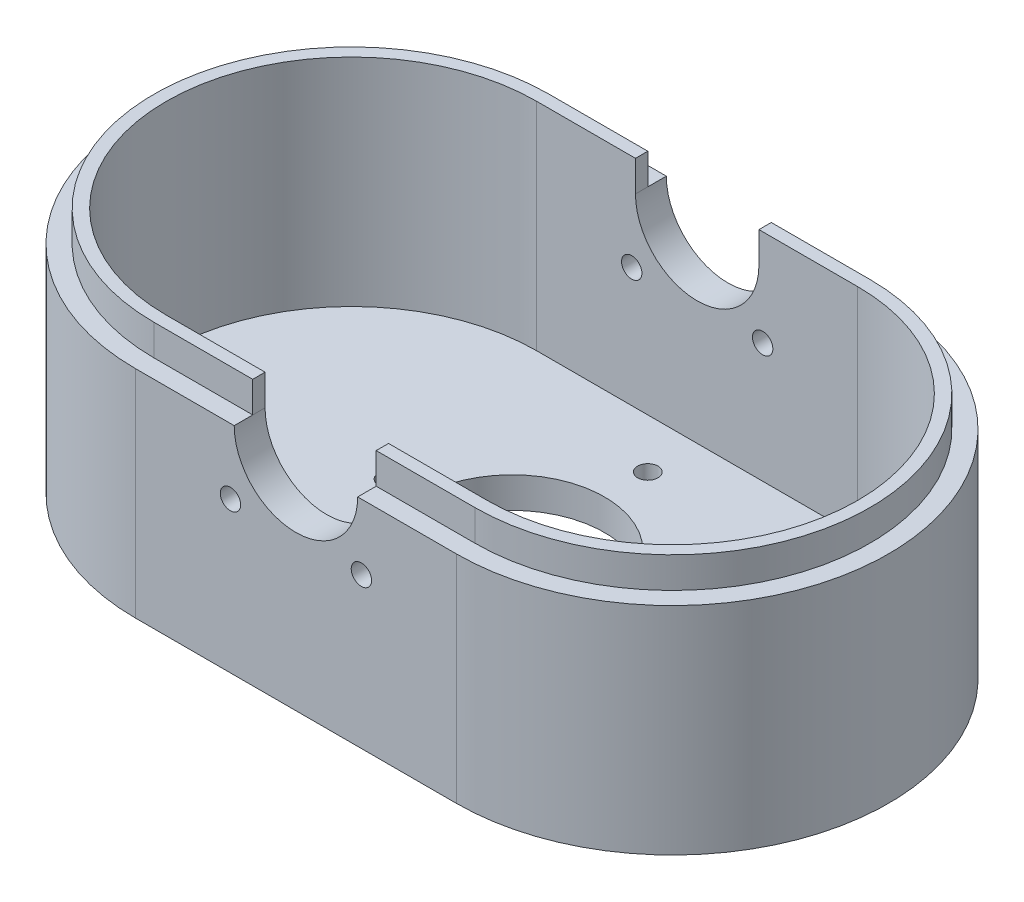
ISO-10303-21;
HEADER;
FILE_DESCRIPTION(('STEP AP214'),'2;1');
FILE_NAME('part.step','',(''),(''),'','','');
FILE_SCHEMA(('AUTOMOTIVE_DESIGN { 1 0 10303 214 1 1 1 1 }'));
ENDSEC;
DATA;
#1=APPLICATION_CONTEXT('core data for automotive mechanical design processes');
#2=APPLICATION_PROTOCOL_DEFINITION('international standard','automotive_design',2000,#1);
#3=PRODUCT_CONTEXT('',#1,'mechanical');
#4=PRODUCT('Part','Part','',(#3));
#5=PRODUCT_RELATED_PRODUCT_CATEGORY('part','',(#4));
#6=PRODUCT_DEFINITION_FORMATION('','',#4);
#7=PRODUCT_DEFINITION_CONTEXT('part definition',#1,'design');
#8=PRODUCT_DEFINITION('design','',#6,#7);
#9=PRODUCT_DEFINITION_SHAPE('','',#8);
#10=(LENGTH_UNIT() NAMED_UNIT(*) SI_UNIT(.MILLI.,.METRE.));
#11=(NAMED_UNIT(*) PLANE_ANGLE_UNIT() SI_UNIT($,.RADIAN.));
#12=(NAMED_UNIT(*) SI_UNIT($,.STERADIAN.) SOLID_ANGLE_UNIT());
#13=UNCERTAINTY_MEASURE_WITH_UNIT(LENGTH_MEASURE(1.E-05),#10,'distance_accuracy_value','');
#14=(GEOMETRIC_REPRESENTATION_CONTEXT(3) GLOBAL_UNCERTAINTY_ASSIGNED_CONTEXT((#13)) GLOBAL_UNIT_ASSIGNED_CONTEXT((#10,
#11,#12)) REPRESENTATION_CONTEXT('',''));
#15=CARTESIAN_POINT('',(0.,0.,0.));
#16=DIRECTION('',(0.,0.,1.));
#17=DIRECTION('',(1.,0.,0.));
#18=AXIS2_PLACEMENT_3D('',#15,#16,#17);
#19=CARTESIAN_POINT('',(26.,35.,0.));
#20=DIRECTION('',(0.,1.,0.));
#21=DIRECTION('',(0.,0.,1.));
#22=AXIS2_PLACEMENT_3D('',#19,#20,#21);
#23=PLANE('',#22);
#24=CARTESIAN_POINT('',(26.,35.,0.));
#25=DIRECTION('',(0.,1.,0.));
#26=DIRECTION('',(0.,0.,1.));
#27=AXIS2_PLACEMENT_3D('',#24,#25,#26);
#28=CIRCLE('',#27,32.);
#29=CARTESIAN_POINT('',(26.,35.,32.));
#30=VERTEX_POINT('',#29);
#31=CARTESIAN_POINT('',(26.,35.,-32.));
#32=VERTEX_POINT('',#31);
#33=EDGE_CURVE('E397',#30,#32,#28,.T.);
#34=ORIENTED_EDGE('',*,*,#33,.F.);
#35=DIRECTION('',(1.,0.,0.));
#36=VECTOR('',#35,1.);
#37=CARTESIAN_POINT('',(10.,35.,32.));
#38=LINE('',#37,#36);
#39=CARTESIAN_POINT('',(10.,35.,32.));
#40=VERTEX_POINT('',#39);
#41=EDGE_CURVE('E366',#40,#30,#38,.T.);
#42=ORIENTED_EDGE('',*,*,#41,.F.);
#43=DIRECTION('',(0.,0.,1.));
#44=VECTOR('',#43,1.);
#45=CARTESIAN_POINT('',(10.,35.,-35.));
#46=LINE('',#45,#44);
#47=CARTESIAN_POINT('',(10.,35.,35.));
#48=VERTEX_POINT('',#47);
#49=EDGE_CURVE('E268',#48,#40,#46,.F.);
#50=ORIENTED_EDGE('',*,*,#49,.F.);
#51=DIRECTION('',(1.,0.,0.));
#52=VECTOR('',#51,1.);
#53=CARTESIAN_POINT('',(-26.,35.,35.));
#54=LINE('',#53,#52);
#55=CARTESIAN_POINT('',(26.,35.,35.));
#56=VERTEX_POINT('',#55);
#57=EDGE_CURVE('E310',#48,#56,#54,.T.);
#58=ORIENTED_EDGE('',*,*,#57,.T.);
#59=CARTESIAN_POINT('',(26.,35.,0.));
#60=DIRECTION('',(0.,1.,0.));
#61=DIRECTION('',(0.,0.,1.));
#62=AXIS2_PLACEMENT_3D('',#59,#60,#61);
#63=CIRCLE('',#62,35.);
#64=CARTESIAN_POINT('',(26.,35.,-35.));
#65=VERTEX_POINT('',#64);
#66=EDGE_CURVE('E300',#56,#65,#63,.T.);
#67=ORIENTED_EDGE('',*,*,#66,.T.);
#68=DIRECTION('',(-1.,0.,0.));
#69=VECTOR('',#68,1.);
#70=CARTESIAN_POINT('',(-26.,35.,-35.));
#71=LINE('',#70,#69);
#72=CARTESIAN_POINT('',(10.,35.,-35.));
#73=VERTEX_POINT('',#72);
#74=EDGE_CURVE('E305',#65,#73,#71,.T.);
#75=ORIENTED_EDGE('',*,*,#74,.T.);
#76=CARTESIAN_POINT('',(10.,35.,-32.));
#77=VERTEX_POINT('',#76);
#78=EDGE_CURVE('E263',#77,#73,#46,.F.);
#79=ORIENTED_EDGE('',*,*,#78,.F.);
#80=DIRECTION('',(-1.,0.,0.));
#81=VECTOR('',#80,1.);
#82=CARTESIAN_POINT('',(26.,35.,-32.));
#83=LINE('',#82,#81);
#84=EDGE_CURVE('E202',#32,#77,#83,.T.);
#85=ORIENTED_EDGE('',*,*,#84,.F.);
#86=EDGE_LOOP('',(#34,#42,#50,#58,#67,#75,#79,#85));
#87=FACE_BOUND('',#86,.T.);
#88=ADVANCED_FACE('F35',(#87),#23,.T.);
#89=CARTESIAN_POINT('',(-26.,35.,0.));
#90=DIRECTION('',(0.,1.,0.));
#91=DIRECTION('',(0.,0.,1.));
#92=AXIS2_PLACEMENT_3D('',#89,#90,#91);
#93=CIRCLE('',#92,32.);
#94=CARTESIAN_POINT('',(-26.,35.,-32.));
#95=VERTEX_POINT('',#94);
#96=CARTESIAN_POINT('',(-26.,35.,32.));
#97=VERTEX_POINT('',#96);
#98=EDGE_CURVE('E238',#95,#97,#93,.T.);
#99=ORIENTED_EDGE('',*,*,#98,.F.);
#100=DIRECTION('',(-1.,0.,0.));
#101=VECTOR('',#100,1.);
#102=CARTESIAN_POINT('',(-9.99999999999999,35.,-32.));
#103=LINE('',#102,#101);
#104=CARTESIAN_POINT('',(-9.99999999999999,35.,-32.));
#105=VERTEX_POINT('',#104);
#106=EDGE_CURVE('E210',#105,#95,#103,.T.);
#107=ORIENTED_EDGE('',*,*,#106,.F.);
#108=DIRECTION('',(0.,0.,1.));
#109=VECTOR('',#108,1.);
#110=CARTESIAN_POINT('',(-9.99999999999999,35.,-35.));
#111=LINE('',#110,#109);
#112=CARTESIAN_POINT('',(-9.99999999999999,35.,-35.));
#113=VERTEX_POINT('',#112);
#114=EDGE_CURVE('E267',#113,#105,#111,.T.);
#115=ORIENTED_EDGE('',*,*,#114,.F.);
#116=CARTESIAN_POINT('',(-26.,35.,-35.));
#117=VERTEX_POINT('',#116);
#118=EDGE_CURVE('E303',#113,#117,#71,.T.);
#119=ORIENTED_EDGE('',*,*,#118,.T.);
#120=CARTESIAN_POINT('',(-26.,35.,0.));
#121=DIRECTION('',(0.,1.,0.));
#122=DIRECTION('',(0.,0.,1.));
#123=AXIS2_PLACEMENT_3D('',#120,#121,#122);
#124=CIRCLE('',#123,35.);
#125=CARTESIAN_POINT('',(-26.,35.,35.));
#126=VERTEX_POINT('',#125);
#127=EDGE_CURVE('E308',#117,#126,#124,.T.);
#128=ORIENTED_EDGE('',*,*,#127,.T.);
#129=CARTESIAN_POINT('',(-9.99999999999999,35.,35.));
#130=VERTEX_POINT('',#129);
#131=EDGE_CURVE('E311',#126,#130,#54,.T.);
#132=ORIENTED_EDGE('',*,*,#131,.T.);
#133=CARTESIAN_POINT('',(-9.99999999999999,35.,32.));
#134=VERTEX_POINT('',#133);
#135=EDGE_CURVE('E272',#134,#130,#111,.T.);
#136=ORIENTED_EDGE('',*,*,#135,.F.);
#137=DIRECTION('',(1.,0.,0.));
#138=VECTOR('',#137,1.);
#139=CARTESIAN_POINT('',(-26.,35.,32.));
#140=LINE('',#139,#138);
#141=EDGE_CURVE('E220',#97,#134,#140,.T.);
#142=ORIENTED_EDGE('',*,*,#141,.F.);
#143=EDGE_LOOP('',(#99,#107,#115,#119,#128,#132,#136,#142));
#144=FACE_BOUND('',#143,.T.);
#145=ADVANCED_FACE('F354',(#144),#23,.T.);
#146=CARTESIAN_POINT('',(26.,35.,0.));
#147=DIRECTION('',(0.,-1.,0.));
#148=DIRECTION('',(0.,0.,-1.));
#149=AXIS2_PLACEMENT_3D('',#146,#147,#148);
#150=CYLINDRICAL_SURFACE('',#149,35.);
#151=CARTESIAN_POINT('',(26.,0.,0.));
#152=DIRECTION('',(0.,1.,0.));
#153=DIRECTION('',(0.,0.,1.));
#154=AXIS2_PLACEMENT_3D('',#151,#152,#153);
#155=CIRCLE('',#154,35.);
#156=CARTESIAN_POINT('',(26.,0.,35.));
#157=VERTEX_POINT('',#156);
#158=CARTESIAN_POINT('',(26.,0.,-35.));
#159=VERTEX_POINT('',#158);
#160=EDGE_CURVE('E294',#157,#159,#155,.T.);
#161=ORIENTED_EDGE('',*,*,#160,.T.);
#162=DIRECTION('',(0.,-1.,0.));
#163=VECTOR('',#162,1.);
#164=CARTESIAN_POINT('',(26.,35.,-35.));
#165=LINE('',#164,#163);
#166=EDGE_CURVE('E43',#65,#159,#165,.T.);
#167=ORIENTED_EDGE('',*,*,#166,.F.);
#168=ORIENTED_EDGE('',*,*,#66,.F.);
#169=DIRECTION('',(0.,-1.,0.));
#170=VECTOR('',#169,1.);
#171=CARTESIAN_POINT('',(26.,35.,35.));
#172=LINE('',#171,#170);
#173=EDGE_CURVE('E314',#56,#157,#172,.T.);
#174=ORIENTED_EDGE('',*,*,#173,.T.);
#175=EDGE_LOOP('',(#161,#167,#168,#174));
#176=FACE_BOUND('',#175,.T.);
#177=ADVANCED_FACE('F37',(#176),#150,.T.);
#178=CARTESIAN_POINT('',(-26.,35.,-35.));
#179=DIRECTION('',(0.,0.,1.));
#180=DIRECTION('',(1.,0.,0.));
#181=AXIS2_PLACEMENT_3D('',#178,#179,#180);
#182=PLANE('',#181);
#183=CARTESIAN_POINT('',(10.6066017177982,24.3933982822018,-35.));
#184=DIRECTION('',(0.,0.,-1.));
#185=DIRECTION('',(-1.,0.,0.));
#186=AXIS2_PLACEMENT_3D('',#183,#184,#185);
#187=CIRCLE('',#186,1.64999999999999);
#188=CARTESIAN_POINT('',(8.95660171779823,24.3933982822018,-35.));
#189=VERTEX_POINT('',#188);
#190=EDGE_CURVE('E431',#189,#189,#187,.T.);
#191=ORIENTED_EDGE('',*,*,#190,.F.);
#192=EDGE_LOOP('',(#191));
#193=FACE_BOUND('',#192,.T.);
#194=CARTESIAN_POINT('',(-10.6066017177982,24.3933982822018,-35.));
#195=DIRECTION('',(0.,0.,-1.));
#196=DIRECTION('',(-1.,0.,0.));
#197=AXIS2_PLACEMENT_3D('',#194,#195,#196);
#198=CIRCLE('',#197,1.64999999999999);
#199=CARTESIAN_POINT('',(-12.2566017177982,24.3933982822018,-35.));
#200=VERTEX_POINT('',#199);
#201=EDGE_CURVE('E425',#200,#200,#198,.T.);
#202=ORIENTED_EDGE('',*,*,#201,.F.);
#203=EDGE_LOOP('',(#202));
#204=FACE_BOUND('',#203,.T.);
#205=ORIENTED_EDGE('',*,*,#118,.F.);
#206=CARTESIAN_POINT('',(0.,35.,-35.));
#207=DIRECTION('',(0.,0.,1.));
#208=DIRECTION('',(1.,0.,0.));
#209=AXIS2_PLACEMENT_3D('',#206,#207,#208);
#210=CIRCLE('',#209,10.);
#211=EDGE_CURVE('E260',#113,#73,#210,.T.);
#212=ORIENTED_EDGE('',*,*,#211,.T.);
#213=ORIENTED_EDGE('',*,*,#74,.F.);
#214=ORIENTED_EDGE('',*,*,#166,.T.);
#215=DIRECTION('',(-1.,0.,0.));
#216=VECTOR('',#215,1.);
#217=CARTESIAN_POINT('',(-26.,0.,-35.));
#218=LINE('',#217,#216);
#219=CARTESIAN_POINT('',(-26.,0.,-35.));
#220=VERTEX_POINT('',#219);
#221=EDGE_CURVE('E317',#159,#220,#218,.T.);
#222=ORIENTED_EDGE('',*,*,#221,.T.);
#223=DIRECTION('',(0.,-1.,0.));
#224=VECTOR('',#223,1.);
#225=CARTESIAN_POINT('',(-26.,35.,-35.));
#226=LINE('',#225,#224);
#227=EDGE_CURVE('E327',#117,#220,#226,.T.);
#228=ORIENTED_EDGE('',*,*,#227,.F.);
#229=EDGE_LOOP('',(#205,#212,#213,#214,#222,#228));
#230=FACE_BOUND('',#229,.T.);
#231=ADVANCED_FACE('F333',(#193,#204,#230),#182,.F.);
#232=CARTESIAN_POINT('',(-26.,35.,0.));
#233=DIRECTION('',(0.,-1.,0.));
#234=DIRECTION('',(0.,0.,-1.));
#235=AXIS2_PLACEMENT_3D('',#232,#233,#234);
#236=CYLINDRICAL_SURFACE('',#235,35.);
#237=CARTESIAN_POINT('',(-26.,0.,0.));
#238=DIRECTION('',(0.,1.,0.));
#239=DIRECTION('',(0.,0.,1.));
#240=AXIS2_PLACEMENT_3D('',#237,#238,#239);
#241=CIRCLE('',#240,35.);
#242=CARTESIAN_POINT('',(-26.,0.,35.));
#243=VERTEX_POINT('',#242);
#244=EDGE_CURVE('E319',#220,#243,#241,.T.);
#245=ORIENTED_EDGE('',*,*,#244,.T.);
#246=DIRECTION('',(0.,-1.,0.));
#247=VECTOR('',#246,1.);
#248=CARTESIAN_POINT('',(-26.,35.,35.));
#249=LINE('',#248,#247);
#250=EDGE_CURVE('E324',#126,#243,#249,.T.);
#251=ORIENTED_EDGE('',*,*,#250,.F.);
#252=ORIENTED_EDGE('',*,*,#127,.F.);
#253=ORIENTED_EDGE('',*,*,#227,.T.);
#254=EDGE_LOOP('',(#245,#251,#252,#253));
#255=FACE_BOUND('',#254,.T.);
#256=ADVANCED_FACE('F345',(#255),#236,.T.);
#257=CARTESIAN_POINT('',(-26.,35.,35.));
#258=DIRECTION('',(0.,0.,-1.));
#259=DIRECTION('',(-1.,0.,0.));
#260=AXIS2_PLACEMENT_3D('',#257,#258,#259);
#261=PLANE('',#260);
#262=CARTESIAN_POINT('',(-10.6066017177982,24.3933982822018,35.));
#263=DIRECTION('',(0.,0.,1.));
#264=DIRECTION('',(1.,0.,0.));
#265=AXIS2_PLACEMENT_3D('',#262,#263,#264);
#266=CIRCLE('',#265,1.65);
#267=CARTESIAN_POINT('',(-8.95660171779819,24.3933982822018,35.));
#268=VERTEX_POINT('',#267);
#269=EDGE_CURVE('E419',#268,#268,#266,.T.);
#270=ORIENTED_EDGE('',*,*,#269,.F.);
#271=EDGE_LOOP('',(#270));
#272=FACE_BOUND('',#271,.T.);
#273=CARTESIAN_POINT('',(10.6066017177982,24.3933982822018,35.));
#274=DIRECTION('',(0.,0.,1.));
#275=DIRECTION('',(1.,0.,0.));
#276=AXIS2_PLACEMENT_3D('',#273,#274,#275);
#277=CIRCLE('',#276,1.65);
#278=CARTESIAN_POINT('',(12.2566017177982,24.3933982822018,35.));
#279=VERTEX_POINT('',#278);
#280=EDGE_CURVE('E413',#279,#279,#277,.T.);
#281=ORIENTED_EDGE('',*,*,#280,.F.);
#282=EDGE_LOOP('',(#281));
#283=FACE_BOUND('',#282,.T.);
#284=ORIENTED_EDGE('',*,*,#57,.F.);
#285=CARTESIAN_POINT('',(0.,35.,35.));
#286=DIRECTION('',(0.,0.,-1.));
#287=DIRECTION('',(-1.,0.,0.));
#288=AXIS2_PLACEMENT_3D('',#285,#286,#287);
#289=CIRCLE('',#288,10.);
#290=EDGE_CURVE('E276',#48,#130,#289,.T.);
#291=ORIENTED_EDGE('',*,*,#290,.T.);
#292=ORIENTED_EDGE('',*,*,#131,.F.);
#293=ORIENTED_EDGE('',*,*,#250,.T.);
#294=DIRECTION('',(1.,0.,0.));
#295=VECTOR('',#294,1.);
#296=CARTESIAN_POINT('',(-26.,0.,35.));
#297=LINE('',#296,#295);
#298=EDGE_CURVE('E304',#243,#157,#297,.T.);
#299=ORIENTED_EDGE('',*,*,#298,.T.);
#300=ORIENTED_EDGE('',*,*,#173,.F.);
#301=EDGE_LOOP('',(#284,#291,#292,#293,#299,#300));
#302=FACE_BOUND('',#301,.T.);
#303=ADVANCED_FACE('F350',(#272,#283,#302),#261,.F.);
#304=CARTESIAN_POINT('',(26.,0.,0.));
#305=DIRECTION('',(0.,1.,0.));
#306=DIRECTION('',(0.,0.,1.));
#307=AXIS2_PLACEMENT_3D('',#304,#305,#306);
#308=PLANE('',#307);
#309=CARTESIAN_POINT('',(0.,0.,-22.));
#310=DIRECTION('',(0.,1.,0.));
#311=DIRECTION('',(0.,0.,1.));
#312=AXIS2_PLACEMENT_3D('',#309,#310,#311);
#313=CIRCLE('',#312,1.64999999999999);
#314=CARTESIAN_POINT('',(0.,0.,-20.35));
#315=VERTEX_POINT('',#314);
#316=EDGE_CURVE('E452',#315,#315,#313,.T.);
#317=ORIENTED_EDGE('',*,*,#316,.T.);
#318=EDGE_LOOP('',(#317));
#319=FACE_BOUND('',#318,.T.);
#320=CARTESIAN_POINT('',(-20.,0.,0.));
#321=DIRECTION('',(0.,1.,0.));
#322=DIRECTION('',(0.,0.,1.));
#323=AXIS2_PLACEMENT_3D('',#320,#321,#322);
#324=CIRCLE('',#323,1.64999999999999);
#325=CARTESIAN_POINT('',(-20.,0.,1.64999999999999));
#326=VERTEX_POINT('',#325);
#327=EDGE_CURVE('E446',#326,#326,#324,.T.);
#328=ORIENTED_EDGE('',*,*,#327,.T.);
#329=EDGE_LOOP('',(#328));
#330=FACE_BOUND('',#329,.T.);
#331=CARTESIAN_POINT('',(50.,0.,0.));
#332=DIRECTION('',(0.,1.,0.));
#333=DIRECTION('',(0.,0.,1.));
#334=AXIS2_PLACEMENT_3D('',#331,#332,#333);
#335=CIRCLE('',#334,1.64999999999999);
#336=CARTESIAN_POINT('',(50.,0.,1.64999999999999));
#337=VERTEX_POINT('',#336);
#338=EDGE_CURVE('E440',#337,#337,#335,.T.);
#339=ORIENTED_EDGE('',*,*,#338,.T.);
#340=EDGE_LOOP('',(#339));
#341=FACE_BOUND('',#340,.T.);
#342=CARTESIAN_POINT('',(0.,0.,22.));
#343=DIRECTION('',(0.,1.,0.));
#344=DIRECTION('',(0.,0.,1.));
#345=AXIS2_PLACEMENT_3D('',#342,#343,#344);
#346=CIRCLE('',#345,1.64999999999999);
#347=CARTESIAN_POINT('',(0.,0.,23.65));
#348=VERTEX_POINT('',#347);
#349=EDGE_CURVE('E434',#348,#348,#346,.T.);
#350=ORIENTED_EDGE('',*,*,#349,.T.);
#351=EDGE_LOOP('',(#350));
#352=FACE_BOUND('',#351,.T.);
#353=CARTESIAN_POINT('',(0.,0.,0.));
#354=DIRECTION('',(0.,1.,0.));
#355=DIRECTION('',(0.,0.,1.));
#356=AXIS2_PLACEMENT_3D('',#353,#354,#355);
#357=CIRCLE('',#356,15.);
#358=CARTESIAN_POINT('',(0.,0.,15.));
#359=VERTEX_POINT('',#358);
#360=EDGE_CURVE('E257',#359,#359,#357,.F.);
#361=ORIENTED_EDGE('',*,*,#360,.F.);
#362=EDGE_LOOP('',(#361));
#363=FACE_BOUND('',#362,.T.);
#364=ORIENTED_EDGE('',*,*,#160,.F.);
#365=ORIENTED_EDGE('',*,*,#298,.F.);
#366=ORIENTED_EDGE('',*,*,#244,.F.);
#367=ORIENTED_EDGE('',*,*,#221,.F.);
#368=EDGE_LOOP('',(#364,#365,#366,#367));
#369=FACE_BOUND('',#368,.T.);
#370=ADVANCED_FACE('F341',(#319,#330,#341,#352,#363,#369),#308,.F.);
#371=CARTESIAN_POINT('',(26.,5.,0.));
#372=DIRECTION('',(0.,1.,0.));
#373=DIRECTION('',(0.,0.,1.));
#374=AXIS2_PLACEMENT_3D('',#371,#372,#373);
#375=CYLINDRICAL_SURFACE('',#374,30.);
#376=DIRECTION('',(0.,1.,0.));
#377=VECTOR('',#376,1.);
#378=CARTESIAN_POINT('',(26.,5.,30.));
#379=LINE('',#378,#377);
#380=CARTESIAN_POINT('',(26.,5.,30.));
#381=VERTEX_POINT('',#380);
#382=CARTESIAN_POINT('',(26.,40.,30.));
#383=VERTEX_POINT('',#382);
#384=EDGE_CURVE('E292',#381,#383,#379,.T.);
#385=ORIENTED_EDGE('',*,*,#384,.T.);
#386=CARTESIAN_POINT('',(26.,40.,0.));
#387=DIRECTION('',(0.,-1.,0.));
#388=DIRECTION('',(0.,0.,1.));
#389=AXIS2_PLACEMENT_3D('',#386,#387,#388);
#390=CIRCLE('',#389,30.);
#391=CARTESIAN_POINT('',(26.,40.,-30.));
#392=VERTEX_POINT('',#391);
#393=EDGE_CURVE('E404',#392,#383,#390,.T.);
#394=ORIENTED_EDGE('',*,*,#393,.F.);
#395=DIRECTION('',(0.,1.,0.));
#396=VECTOR('',#395,1.);
#397=CARTESIAN_POINT('',(26.,5.,-30.));
#398=LINE('',#397,#396);
#399=CARTESIAN_POINT('',(26.,5.,-30.));
#400=VERTEX_POINT('',#399);
#401=EDGE_CURVE('E291',#400,#392,#398,.T.);
#402=ORIENTED_EDGE('',*,*,#401,.F.);
#403=CARTESIAN_POINT('',(26.,5.,0.));
#404=DIRECTION('',(0.,1.,0.));
#405=DIRECTION('',(0.,0.,1.));
#406=AXIS2_PLACEMENT_3D('',#403,#404,#405);
#407=CIRCLE('',#406,30.);
#408=EDGE_CURVE('E279',#381,#400,#407,.T.);
#409=ORIENTED_EDGE('',*,*,#408,.F.);
#410=EDGE_LOOP('',(#385,#394,#402,#409));
#411=FACE_BOUND('',#410,.T.);
#412=ADVANCED_FACE('F477',(#411),#375,.F.);
#413=CARTESIAN_POINT('',(-26.,5.,30.));
#414=DIRECTION('',(0.,0.,1.));
#415=DIRECTION('',(1.,0.,0.));
#416=AXIS2_PLACEMENT_3D('',#413,#414,#415);
#417=PLANE('',#416);
#418=CARTESIAN_POINT('',(-10.6066017177982,24.3933982822018,30.));
#419=DIRECTION('',(0.,0.,1.));
#420=DIRECTION('',(1.,0.,0.));
#421=AXIS2_PLACEMENT_3D('',#418,#419,#420);
#422=CIRCLE('',#421,1.65);
#423=CARTESIAN_POINT('',(-8.95660171779819,24.3933982822018,30.));
#424=VERTEX_POINT('',#423);
#425=EDGE_CURVE('E416',#424,#424,#422,.T.);
#426=ORIENTED_EDGE('',*,*,#425,.T.);
#427=EDGE_LOOP('',(#426));
#428=FACE_BOUND('',#427,.T.);
#429=CARTESIAN_POINT('',(10.6066017177982,24.3933982822018,30.));
#430=DIRECTION('',(0.,0.,1.));
#431=DIRECTION('',(1.,0.,0.));
#432=AXIS2_PLACEMENT_3D('',#429,#430,#431);
#433=CIRCLE('',#432,1.65);
#434=CARTESIAN_POINT('',(12.2566017177982,24.3933982822018,30.));
#435=VERTEX_POINT('',#434);
#436=EDGE_CURVE('E402',#435,#435,#433,.T.);
#437=ORIENTED_EDGE('',*,*,#436,.T.);
#438=EDGE_LOOP('',(#437));
#439=FACE_BOUND('',#438,.T.);
#440=DIRECTION('',(0.,1.,0.));
#441=VECTOR('',#440,1.);
#442=CARTESIAN_POINT('',(-26.,5.,30.));
#443=LINE('',#442,#441);
#444=CARTESIAN_POINT('',(-26.,5.,30.));
#445=VERTEX_POINT('',#444);
#446=CARTESIAN_POINT('',(-26.,40.,30.));
#447=VERTEX_POINT('',#446);
#448=EDGE_CURVE('E295',#445,#447,#443,.T.);
#449=ORIENTED_EDGE('',*,*,#448,.T.);
#450=DIRECTION('',(-1.,0.,0.));
#451=VECTOR('',#450,1.);
#452=CARTESIAN_POINT('',(-26.,40.,30.));
#453=LINE('',#452,#451);
#454=CARTESIAN_POINT('',(-9.99999999999999,40.,30.));
#455=VERTEX_POINT('',#454);
#456=EDGE_CURVE('E228',#455,#447,#453,.T.);
#457=ORIENTED_EDGE('',*,*,#456,.F.);
#458=DIRECTION('',(0.,-1.,0.));
#459=VECTOR('',#458,1.);
#460=CARTESIAN_POINT('',(-9.99999999999999,40.,30.));
#461=LINE('',#460,#459);
#462=CARTESIAN_POINT('',(-9.99999999999999,35.,30.));
#463=VERTEX_POINT('',#462);
#464=EDGE_CURVE('E242',#455,#463,#461,.T.);
#465=ORIENTED_EDGE('',*,*,#464,.T.);
#466=CARTESIAN_POINT('',(0.,35.,30.));
#467=DIRECTION('',(0.,0.,1.));
#468=DIRECTION('',(1.,0.,0.));
#469=AXIS2_PLACEMENT_3D('',#466,#467,#468);
#470=CIRCLE('',#469,10.);
#471=CARTESIAN_POINT('',(10.,35.,30.));
#472=VERTEX_POINT('',#471);
#473=EDGE_CURVE('E271',#463,#472,#470,.T.);
#474=ORIENTED_EDGE('',*,*,#473,.T.);
#475=DIRECTION('',(0.,-1.,0.));
#476=VECTOR('',#475,1.);
#477=CARTESIAN_POINT('',(10.,40.,30.));
#478=LINE('',#477,#476);
#479=CARTESIAN_POINT('',(10.,40.,30.));
#480=VERTEX_POINT('',#479);
#481=EDGE_CURVE('E58',#480,#472,#478,.T.);
#482=ORIENTED_EDGE('',*,*,#481,.F.);
#483=DIRECTION('',(-1.,0.,0.));
#484=VECTOR('',#483,1.);
#485=CARTESIAN_POINT('',(10.,40.,30.));
#486=LINE('',#485,#484);
#487=EDGE_CURVE('E201',#383,#480,#486,.T.);
#488=ORIENTED_EDGE('',*,*,#487,.F.);
#489=ORIENTED_EDGE('',*,*,#384,.F.);
#490=DIRECTION('',(1.,0.,0.));
#491=VECTOR('',#490,1.);
#492=CARTESIAN_POINT('',(-26.,5.,30.));
#493=LINE('',#492,#491);
#494=EDGE_CURVE('E288',#445,#381,#493,.T.);
#495=ORIENTED_EDGE('',*,*,#494,.F.);
#496=EDGE_LOOP('',(#449,#457,#465,#474,#482,#488,#489,#495));
#497=FACE_BOUND('',#496,.T.);
#498=ADVANCED_FACE('F485',(#428,#439,#497),#417,.F.);
#499=CARTESIAN_POINT('',(-26.,5.,0.));
#500=DIRECTION('',(0.,1.,0.));
#501=DIRECTION('',(0.,0.,1.));
#502=AXIS2_PLACEMENT_3D('',#499,#500,#501);
#503=CYLINDRICAL_SURFACE('',#502,30.);
#504=DIRECTION('',(0.,1.,0.));
#505=VECTOR('',#504,1.);
#506=CARTESIAN_POINT('',(-26.,5.,-30.));
#507=LINE('',#506,#505);
#508=CARTESIAN_POINT('',(-26.,5.,-30.));
#509=VERTEX_POINT('',#508);
#510=CARTESIAN_POINT('',(-26.,40.,-30.));
#511=VERTEX_POINT('',#510);
#512=EDGE_CURVE('E297',#509,#511,#507,.T.);
#513=ORIENTED_EDGE('',*,*,#512,.T.);
#514=CARTESIAN_POINT('',(-26.,40.,0.));
#515=DIRECTION('',(0.,-1.,0.));
#516=DIRECTION('',(0.,0.,1.));
#517=AXIS2_PLACEMENT_3D('',#514,#515,#516);
#518=CIRCLE('',#517,30.);
#519=EDGE_CURVE('E231',#447,#511,#518,.T.);
#520=ORIENTED_EDGE('',*,*,#519,.F.);
#521=ORIENTED_EDGE('',*,*,#448,.F.);
#522=CARTESIAN_POINT('',(-26.,5.,0.));
#523=DIRECTION('',(0.,1.,0.));
#524=DIRECTION('',(0.,0.,1.));
#525=AXIS2_PLACEMENT_3D('',#522,#523,#524);
#526=CIRCLE('',#525,30.);
#527=EDGE_CURVE('E285',#509,#445,#526,.T.);
#528=ORIENTED_EDGE('',*,*,#527,.F.);
#529=EDGE_LOOP('',(#513,#520,#521,#528));
#530=FACE_BOUND('',#529,.T.);
#531=ADVANCED_FACE('F483',(#530),#503,.F.);
#532=CARTESIAN_POINT('',(26.,5.,-30.));
#533=DIRECTION('',(0.,0.,-1.));
#534=DIRECTION('',(-1.,0.,0.));
#535=AXIS2_PLACEMENT_3D('',#532,#533,#534);
#536=PLANE('',#535);
#537=CARTESIAN_POINT('',(10.6066017177982,24.3933982822018,-30.));
#538=DIRECTION('',(0.,0.,-1.));
#539=DIRECTION('',(-1.,0.,0.));
#540=AXIS2_PLACEMENT_3D('',#537,#538,#539);
#541=CIRCLE('',#540,1.64999999999999);
#542=CARTESIAN_POINT('',(8.95660171779823,24.3933982822018,-30.));
#543=VERTEX_POINT('',#542);
#544=EDGE_CURVE('E428',#543,#543,#541,.T.);
#545=ORIENTED_EDGE('',*,*,#544,.T.);
#546=EDGE_LOOP('',(#545));
#547=FACE_BOUND('',#546,.T.);
#548=CARTESIAN_POINT('',(-10.6066017177982,24.3933982822018,-30.));
#549=DIRECTION('',(0.,0.,-1.));
#550=DIRECTION('',(-1.,0.,0.));
#551=AXIS2_PLACEMENT_3D('',#548,#549,#550);
#552=CIRCLE('',#551,1.64999999999999);
#553=CARTESIAN_POINT('',(-12.2566017177982,24.3933982822018,-30.));
#554=VERTEX_POINT('',#553);
#555=EDGE_CURVE('E422',#554,#554,#552,.T.);
#556=ORIENTED_EDGE('',*,*,#555,.T.);
#557=EDGE_LOOP('',(#556));
#558=FACE_BOUND('',#557,.T.);
#559=ORIENTED_EDGE('',*,*,#401,.T.);
#560=DIRECTION('',(1.,0.,0.));
#561=VECTOR('',#560,1.);
#562=CARTESIAN_POINT('',(26.,40.,-30.));
#563=LINE('',#562,#561);
#564=CARTESIAN_POINT('',(10.,40.,-30.));
#565=VERTEX_POINT('',#564);
#566=EDGE_CURVE('E385',#565,#392,#563,.T.);
#567=ORIENTED_EDGE('',*,*,#566,.F.);
#568=DIRECTION('',(0.,-1.,0.));
#569=VECTOR('',#568,1.);
#570=CARTESIAN_POINT('',(10.,40.,-30.));
#571=LINE('',#570,#569);
#572=CARTESIAN_POINT('',(10.,35.,-30.));
#573=VERTEX_POINT('',#572);
#574=EDGE_CURVE('E377',#565,#573,#571,.T.);
#575=ORIENTED_EDGE('',*,*,#574,.T.);
#576=CARTESIAN_POINT('',(0.,35.,-30.));
#577=DIRECTION('',(0.,0.,-1.));
#578=DIRECTION('',(-1.,0.,0.));
#579=AXIS2_PLACEMENT_3D('',#576,#577,#578);
#580=CIRCLE('',#579,10.);
#581=CARTESIAN_POINT('',(-9.99999999999999,35.,-30.));
#582=VERTEX_POINT('',#581);
#583=EDGE_CURVE('E11',#573,#582,#580,.T.);
#584=ORIENTED_EDGE('',*,*,#583,.T.);
#585=DIRECTION('',(0.,-1.,0.));
#586=VECTOR('',#585,1.);
#587=CARTESIAN_POINT('',(-9.99999999999999,40.,-30.));
#588=LINE('',#587,#586);
#589=CARTESIAN_POINT('',(-9.99999999999999,40.,-30.));
#590=VERTEX_POINT('',#589);
#591=EDGE_CURVE('E235',#590,#582,#588,.T.);
#592=ORIENTED_EDGE('',*,*,#591,.F.);
#593=DIRECTION('',(1.,0.,0.));
#594=VECTOR('',#593,1.);
#595=CARTESIAN_POINT('',(-9.99999999999999,40.,-30.));
#596=LINE('',#595,#594);
#597=EDGE_CURVE('E234',#511,#590,#596,.T.);
#598=ORIENTED_EDGE('',*,*,#597,.F.);
#599=ORIENTED_EDGE('',*,*,#512,.F.);
#600=DIRECTION('',(-1.,0.,0.));
#601=VECTOR('',#600,1.);
#602=CARTESIAN_POINT('',(26.,5.,-30.));
#603=LINE('',#602,#601);
#604=EDGE_CURVE('E282',#400,#509,#603,.T.);
#605=ORIENTED_EDGE('',*,*,#604,.F.);
#606=EDGE_LOOP('',(#559,#567,#575,#584,#592,#598,#599,#605));
#607=FACE_BOUND('',#606,.T.);
#608=ADVANCED_FACE('F382',(#547,#558,#607),#536,.F.);
#609=CARTESIAN_POINT('',(26.,5.,0.));
#610=DIRECTION('',(0.,1.,0.));
#611=DIRECTION('',(0.,0.,1.));
#612=AXIS2_PLACEMENT_3D('',#609,#610,#611);
#613=PLANE('',#612);
#614=CARTESIAN_POINT('',(0.,5.00000000000001,-22.));
#615=DIRECTION('',(0.,1.,0.));
#616=DIRECTION('',(0.,0.,1.));
#617=AXIS2_PLACEMENT_3D('',#614,#615,#616);
#618=CIRCLE('',#617,1.64999999999999);
#619=CARTESIAN_POINT('',(0.,5.00000000000001,-20.35));
#620=VERTEX_POINT('',#619);
#621=EDGE_CURVE('E455',#620,#620,#618,.T.);
#622=ORIENTED_EDGE('',*,*,#621,.F.);
#623=EDGE_LOOP('',(#622));
#624=FACE_BOUND('',#623,.T.);
#625=CARTESIAN_POINT('',(-20.,5.00000000000001,0.));
#626=DIRECTION('',(0.,1.,0.));
#627=DIRECTION('',(0.,0.,1.));
#628=AXIS2_PLACEMENT_3D('',#625,#626,#627);
#629=CIRCLE('',#628,1.64999999999999);
#630=CARTESIAN_POINT('',(-20.,5.00000000000001,1.64999999999999));
#631=VERTEX_POINT('',#630);
#632=EDGE_CURVE('E449',#631,#631,#629,.T.);
#633=ORIENTED_EDGE('',*,*,#632,.F.);
#634=EDGE_LOOP('',(#633));
#635=FACE_BOUND('',#634,.T.);
#636=CARTESIAN_POINT('',(50.,5.00000000000001,0.));
#637=DIRECTION('',(0.,1.,0.));
#638=DIRECTION('',(0.,0.,1.));
#639=AXIS2_PLACEMENT_3D('',#636,#637,#638);
#640=CIRCLE('',#639,1.64999999999998);
#641=CARTESIAN_POINT('',(50.,5.00000000000001,1.64999999999998));
#642=VERTEX_POINT('',#641);
#643=EDGE_CURVE('E443',#642,#642,#640,.T.);
#644=ORIENTED_EDGE('',*,*,#643,.F.);
#645=EDGE_LOOP('',(#644));
#646=FACE_BOUND('',#645,.T.);
#647=CARTESIAN_POINT('',(0.,5.00000000000001,22.));
#648=DIRECTION('',(0.,1.,0.));
#649=DIRECTION('',(0.,0.,1.));
#650=AXIS2_PLACEMENT_3D('',#647,#648,#649);
#651=CIRCLE('',#650,1.64999999999999);
#652=CARTESIAN_POINT('',(0.,5.00000000000001,23.65));
#653=VERTEX_POINT('',#652);
#654=EDGE_CURVE('E437',#653,#653,#651,.T.);
#655=ORIENTED_EDGE('',*,*,#654,.F.);
#656=EDGE_LOOP('',(#655));
#657=FACE_BOUND('',#656,.T.);
#658=CARTESIAN_POINT('',(0.,5.,0.));
#659=DIRECTION('',(0.,1.,0.));
#660=DIRECTION('',(0.,0.,1.));
#661=AXIS2_PLACEMENT_3D('',#658,#659,#660);
#662=CIRCLE('',#661,15.);
#663=CARTESIAN_POINT('',(0.,5.,15.));
#664=VERTEX_POINT('',#663);
#665=EDGE_CURVE('E254',#664,#664,#662,.T.);
#666=ORIENTED_EDGE('',*,*,#665,.F.);
#667=EDGE_LOOP('',(#666));
#668=FACE_BOUND('',#667,.T.);
#669=ORIENTED_EDGE('',*,*,#408,.T.);
#670=ORIENTED_EDGE('',*,*,#604,.T.);
#671=ORIENTED_EDGE('',*,*,#527,.T.);
#672=ORIENTED_EDGE('',*,*,#494,.T.);
#673=EDGE_LOOP('',(#669,#670,#671,#672));
#674=FACE_BOUND('',#673,.T.);
#675=ADVANCED_FACE('F461',(#624,#635,#646,#657,#668,#674),#613,.T.);
#676=CARTESIAN_POINT('',(0.,35.,-35.));
#677=DIRECTION('',(0.,0.,1.));
#678=DIRECTION('',(1.,0.,0.));
#679=AXIS2_PLACEMENT_3D('',#676,#677,#678);
#680=CYLINDRICAL_SURFACE('',#679,10.);
#681=ORIENTED_EDGE('',*,*,#114,.T.);
#682=DIRECTION('',(0.,0.,-1.));
#683=VECTOR('',#682,1.);
#684=CARTESIAN_POINT('',(-9.99999999999999,35.,-32.));
#685=LINE('',#684,#683);
#686=EDGE_CURVE('E207',#582,#105,#685,.T.);
#687=ORIENTED_EDGE('',*,*,#686,.F.);
#688=ORIENTED_EDGE('',*,*,#583,.F.);
#689=EDGE_CURVE('E264',#573,#77,#46,.F.);
#690=ORIENTED_EDGE('',*,*,#689,.T.);
#691=ORIENTED_EDGE('',*,*,#78,.T.);
#692=ORIENTED_EDGE('',*,*,#211,.F.);
#693=EDGE_LOOP('',(#681,#687,#688,#690,#691,#692));
#694=FACE_BOUND('',#693,.T.);
#695=ADVANCED_FACE('F368',(#694),#680,.F.);
#696=ORIENTED_EDGE('',*,*,#49,.T.);
#697=DIRECTION('',(0.,0.,1.));
#698=VECTOR('',#697,1.);
#699=CARTESIAN_POINT('',(10.,35.,30.));
#700=LINE('',#699,#698);
#701=EDGE_CURVE('E205',#472,#40,#700,.T.);
#702=ORIENTED_EDGE('',*,*,#701,.F.);
#703=ORIENTED_EDGE('',*,*,#473,.F.);
#704=EDGE_CURVE('E273',#463,#134,#111,.T.);
#705=ORIENTED_EDGE('',*,*,#704,.T.);
#706=ORIENTED_EDGE('',*,*,#135,.T.);
#707=ORIENTED_EDGE('',*,*,#290,.F.);
#708=EDGE_LOOP('',(#696,#702,#703,#705,#706,#707));
#709=FACE_BOUND('',#708,.T.);
#710=ADVANCED_FACE('F489',(#709),#680,.F.);
#711=CARTESIAN_POINT('',(0.,-0.00100000000000013,0.));
#712=DIRECTION('',(0.,1.,0.));
#713=DIRECTION('',(0.,0.,1.));
#714=AXIS2_PLACEMENT_3D('',#711,#712,#713);
#715=CYLINDRICAL_SURFACE('',#714,15.);
#716=ORIENTED_EDGE('',*,*,#665,.T.);
#717=EDGE_LOOP('',(#716));
#718=FACE_BOUND('',#717,.T.);
#719=ORIENTED_EDGE('',*,*,#360,.T.);
#720=EDGE_LOOP('',(#719));
#721=FACE_BOUND('',#720,.T.);
#722=ADVANCED_FACE('F508',(#718,#721),#715,.F.);
#723=CARTESIAN_POINT('',(-9.99999999999999,40.,-32.));
#724=DIRECTION('',(-1.,0.,0.));
#725=DIRECTION('',(0.,0.,1.));
#726=AXIS2_PLACEMENT_3D('',#723,#724,#725);
#727=PLANE('',#726);
#728=ORIENTED_EDGE('',*,*,#686,.T.);
#729=DIRECTION('',(0.,-1.,0.));
#730=VECTOR('',#729,1.);
#731=CARTESIAN_POINT('',(-9.99999999999999,40.,-32.));
#732=LINE('',#731,#730);
#733=CARTESIAN_POINT('',(-9.99999999999999,40.,-32.));
#734=VERTEX_POINT('',#733);
#735=EDGE_CURVE('E252',#734,#105,#732,.T.);
#736=ORIENTED_EDGE('',*,*,#735,.F.);
#737=DIRECTION('',(0.,0.,-1.));
#738=VECTOR('',#737,1.);
#739=CARTESIAN_POINT('',(-9.99999999999999,40.,-32.));
#740=LINE('',#739,#738);
#741=EDGE_CURVE('E216',#590,#734,#740,.T.);
#742=ORIENTED_EDGE('',*,*,#741,.F.);
#743=ORIENTED_EDGE('',*,*,#591,.T.);
#744=EDGE_LOOP('',(#728,#736,#742,#743));
#745=FACE_BOUND('',#744,.T.);
#746=ADVANCED_FACE('F506',(#745),#727,.F.);
#747=CARTESIAN_POINT('',(-9.99999999999999,40.,-32.));
#748=DIRECTION('',(0.,0.,1.));
#749=DIRECTION('',(1.,0.,0.));
#750=AXIS2_PLACEMENT_3D('',#747,#748,#749);
#751=PLANE('',#750);
#752=ORIENTED_EDGE('',*,*,#106,.T.);
#753=DIRECTION('',(0.,-1.,0.));
#754=VECTOR('',#753,1.);
#755=CARTESIAN_POINT('',(-26.,40.,-32.));
#756=LINE('',#755,#754);
#757=CARTESIAN_POINT('',(-26.,40.,-32.));
#758=VERTEX_POINT('',#757);
#759=EDGE_CURVE('E249',#758,#95,#756,.T.);
#760=ORIENTED_EDGE('',*,*,#759,.F.);
#761=DIRECTION('',(-1.,0.,0.));
#762=VECTOR('',#761,1.);
#763=CARTESIAN_POINT('',(-9.99999999999999,40.,-32.));
#764=LINE('',#763,#762);
#765=EDGE_CURVE('E219',#734,#758,#764,.T.);
#766=ORIENTED_EDGE('',*,*,#765,.F.);
#767=ORIENTED_EDGE('',*,*,#735,.T.);
#768=EDGE_LOOP('',(#752,#760,#766,#767));
#769=FACE_BOUND('',#768,.T.);
#770=ADVANCED_FACE('F502',(#769),#751,.F.);
#771=CARTESIAN_POINT('',(-26.,40.,0.));
#772=DIRECTION('',(0.,-1.,0.));
#773=DIRECTION('',(0.,0.,-1.));
#774=AXIS2_PLACEMENT_3D('',#771,#772,#773);
#775=CYLINDRICAL_SURFACE('',#774,32.);
#776=ORIENTED_EDGE('',*,*,#98,.T.);
#777=DIRECTION('',(0.,-1.,0.));
#778=VECTOR('',#777,1.);
#779=CARTESIAN_POINT('',(-26.,40.,32.));
#780=LINE('',#779,#778);
#781=CARTESIAN_POINT('',(-26.,40.,32.));
#782=VERTEX_POINT('',#781);
#783=EDGE_CURVE('E246',#782,#97,#780,.T.);
#784=ORIENTED_EDGE('',*,*,#783,.F.);
#785=CARTESIAN_POINT('',(-26.,40.,0.));
#786=DIRECTION('',(0.,1.,0.));
#787=DIRECTION('',(0.,0.,1.));
#788=AXIS2_PLACEMENT_3D('',#785,#786,#787);
#789=CIRCLE('',#788,32.);
#790=EDGE_CURVE('E222',#758,#782,#789,.T.);
#791=ORIENTED_EDGE('',*,*,#790,.F.);
#792=ORIENTED_EDGE('',*,*,#759,.T.);
#793=EDGE_LOOP('',(#776,#784,#791,#792));
#794=FACE_BOUND('',#793,.T.);
#795=ADVANCED_FACE('F499',(#794),#775,.T.);
#796=CARTESIAN_POINT('',(-26.,40.,32.));
#797=DIRECTION('',(0.,0.,-1.));
#798=DIRECTION('',(-1.,0.,0.));
#799=AXIS2_PLACEMENT_3D('',#796,#797,#798);
#800=PLANE('',#799);
#801=ORIENTED_EDGE('',*,*,#141,.T.);
#802=DIRECTION('',(0.,-1.,0.));
#803=VECTOR('',#802,1.);
#804=CARTESIAN_POINT('',(-9.99999999999999,40.,32.));
#805=LINE('',#804,#803);
#806=CARTESIAN_POINT('',(-9.99999999999999,40.,32.));
#807=VERTEX_POINT('',#806);
#808=EDGE_CURVE('E50',#807,#134,#805,.T.);
#809=ORIENTED_EDGE('',*,*,#808,.F.);
#810=DIRECTION('',(1.,0.,0.));
#811=VECTOR('',#810,1.);
#812=CARTESIAN_POINT('',(-26.,40.,32.));
#813=LINE('',#812,#811);
#814=EDGE_CURVE('E224',#782,#807,#813,.T.);
#815=ORIENTED_EDGE('',*,*,#814,.F.);
#816=ORIENTED_EDGE('',*,*,#783,.T.);
#817=EDGE_LOOP('',(#801,#809,#815,#816));
#818=FACE_BOUND('',#817,.T.);
#819=ADVANCED_FACE('F497',(#818),#800,.F.);
#820=CARTESIAN_POINT('',(-9.99999999999999,40.,30.));
#821=DIRECTION('',(-1.,0.,0.));
#822=DIRECTION('',(0.,0.,1.));
#823=AXIS2_PLACEMENT_3D('',#820,#821,#822);
#824=PLANE('',#823);
#825=ORIENTED_EDGE('',*,*,#704,.F.);
#826=ORIENTED_EDGE('',*,*,#464,.F.);
#827=DIRECTION('',(0.,0.,-1.));
#828=VECTOR('',#827,1.);
#829=CARTESIAN_POINT('',(-9.99999999999999,40.,30.));
#830=LINE('',#829,#828);
#831=EDGE_CURVE('E226',#807,#455,#830,.T.);
#832=ORIENTED_EDGE('',*,*,#831,.F.);
#833=ORIENTED_EDGE('',*,*,#808,.T.);
#834=EDGE_LOOP('',(#825,#826,#832,#833));
#835=FACE_BOUND('',#834,.T.);
#836=ADVANCED_FACE('F490',(#835),#824,.F.);
#837=CARTESIAN_POINT('',(-26.,40.,0.));
#838=DIRECTION('',(0.,1.,0.));
#839=DIRECTION('',(0.,0.,1.));
#840=AXIS2_PLACEMENT_3D('',#837,#838,#839);
#841=PLANE('',#840);
#842=ORIENTED_EDGE('',*,*,#741,.T.);
#843=ORIENTED_EDGE('',*,*,#765,.T.);
#844=ORIENTED_EDGE('',*,*,#790,.T.);
#845=ORIENTED_EDGE('',*,*,#814,.T.);
#846=ORIENTED_EDGE('',*,*,#831,.T.);
#847=ORIENTED_EDGE('',*,*,#456,.T.);
#848=ORIENTED_EDGE('',*,*,#519,.T.);
#849=ORIENTED_EDGE('',*,*,#597,.T.);
#850=EDGE_LOOP('',(#842,#843,#844,#845,#846,#847,#848,#849));
#851=FACE_BOUND('',#850,.T.);
#852=ADVANCED_FACE('F492',(#851),#841,.T.);
#853=CARTESIAN_POINT('',(10.,40.,30.));
#854=DIRECTION('',(1.,0.,0.));
#855=DIRECTION('',(0.,0.,-1.));
#856=AXIS2_PLACEMENT_3D('',#853,#854,#855);
#857=PLANE('',#856);
#858=ORIENTED_EDGE('',*,*,#701,.T.);
#859=DIRECTION('',(0.,-1.,0.));
#860=VECTOR('',#859,1.);
#861=CARTESIAN_POINT('',(10.,40.,32.));
#862=LINE('',#861,#860);
#863=CARTESIAN_POINT('',(10.,40.,32.));
#864=VERTEX_POINT('',#863);
#865=EDGE_CURVE('E190',#864,#40,#862,.T.);
#866=ORIENTED_EDGE('',*,*,#865,.F.);
#867=DIRECTION('',(0.,0.,1.));
#868=VECTOR('',#867,1.);
#869=CARTESIAN_POINT('',(10.,40.,30.));
#870=LINE('',#869,#868);
#871=EDGE_CURVE('E196',#480,#864,#870,.T.);
#872=ORIENTED_EDGE('',*,*,#871,.F.);
#873=ORIENTED_EDGE('',*,*,#481,.T.);
#874=EDGE_LOOP('',(#858,#866,#872,#873));
#875=FACE_BOUND('',#874,.T.);
#876=ADVANCED_FACE('F204',(#875),#857,.F.);
#877=CARTESIAN_POINT('',(10.,40.,32.));
#878=DIRECTION('',(0.,0.,-1.));
#879=DIRECTION('',(-1.,0.,0.));
#880=AXIS2_PLACEMENT_3D('',#877,#878,#879);
#881=PLANE('',#880);
#882=ORIENTED_EDGE('',*,*,#41,.T.);
#883=DIRECTION('',(0.,-1.,0.));
#884=VECTOR('',#883,1.);
#885=CARTESIAN_POINT('',(26.,40.,32.));
#886=LINE('',#885,#884);
#887=CARTESIAN_POINT('',(26.,40.,32.));
#888=VERTEX_POINT('',#887);
#889=EDGE_CURVE('E192',#888,#30,#886,.T.);
#890=ORIENTED_EDGE('',*,*,#889,.F.);
#891=DIRECTION('',(1.,0.,0.));
#892=VECTOR('',#891,1.);
#893=CARTESIAN_POINT('',(10.,40.,32.));
#894=LINE('',#893,#892);
#895=EDGE_CURVE('E186',#864,#888,#894,.T.);
#896=ORIENTED_EDGE('',*,*,#895,.F.);
#897=ORIENTED_EDGE('',*,*,#865,.T.);
#898=EDGE_LOOP('',(#882,#890,#896,#897));
#899=FACE_BOUND('',#898,.T.);
#900=ADVANCED_FACE('F188',(#899),#881,.F.);
#901=CARTESIAN_POINT('',(26.,40.,0.));
#902=DIRECTION('',(0.,-1.,0.));
#903=DIRECTION('',(0.,0.,-1.));
#904=AXIS2_PLACEMENT_3D('',#901,#902,#903);
#905=CYLINDRICAL_SURFACE('',#904,32.);
#906=ORIENTED_EDGE('',*,*,#33,.T.);
#907=DIRECTION('',(0.,-1.,0.));
#908=VECTOR('',#907,1.);
#909=CARTESIAN_POINT('',(26.,40.,-32.));
#910=LINE('',#909,#908);
#911=CARTESIAN_POINT('',(26.,40.,-32.));
#912=VERTEX_POINT('',#911);
#913=EDGE_CURVE('E212',#912,#32,#910,.T.);
#914=ORIENTED_EDGE('',*,*,#913,.F.);
#915=CARTESIAN_POINT('',(26.,40.,0.));
#916=DIRECTION('',(0.,1.,0.));
#917=DIRECTION('',(0.,0.,1.));
#918=AXIS2_PLACEMENT_3D('',#915,#916,#917);
#919=CIRCLE('',#918,32.);
#920=EDGE_CURVE('E195',#888,#912,#919,.T.);
#921=ORIENTED_EDGE('',*,*,#920,.F.);
#922=ORIENTED_EDGE('',*,*,#889,.T.);
#923=EDGE_LOOP('',(#906,#914,#921,#922));
#924=FACE_BOUND('',#923,.T.);
#925=ADVANCED_FACE('F569',(#924),#905,.T.);
#926=CARTESIAN_POINT('',(26.,40.,-32.));
#927=DIRECTION('',(0.,0.,1.));
#928=DIRECTION('',(1.,0.,0.));
#929=AXIS2_PLACEMENT_3D('',#926,#927,#928);
#930=PLANE('',#929);
#931=ORIENTED_EDGE('',*,*,#84,.T.);
#932=DIRECTION('',(0.,-1.,0.));
#933=VECTOR('',#932,1.);
#934=CARTESIAN_POINT('',(10.,40.,-32.));
#935=LINE('',#934,#933);
#936=CARTESIAN_POINT('',(10.,40.,-32.));
#937=VERTEX_POINT('',#936);
#938=EDGE_CURVE('E380',#937,#77,#935,.T.);
#939=ORIENTED_EDGE('',*,*,#938,.F.);
#940=DIRECTION('',(-1.,0.,0.));
#941=VECTOR('',#940,1.);
#942=CARTESIAN_POINT('',(26.,40.,-32.));
#943=LINE('',#942,#941);
#944=EDGE_CURVE('E395',#912,#937,#943,.T.);
#945=ORIENTED_EDGE('',*,*,#944,.F.);
#946=ORIENTED_EDGE('',*,*,#913,.T.);
#947=EDGE_LOOP('',(#931,#939,#945,#946));
#948=FACE_BOUND('',#947,.T.);
#949=ADVANCED_FACE('F394',(#948),#930,.F.);
#950=CARTESIAN_POINT('',(10.,40.,-32.));
#951=DIRECTION('',(1.,0.,0.));
#952=DIRECTION('',(0.,0.,-1.));
#953=AXIS2_PLACEMENT_3D('',#950,#951,#952);
#954=PLANE('',#953);
#955=ORIENTED_EDGE('',*,*,#689,.F.);
#956=ORIENTED_EDGE('',*,*,#574,.F.);
#957=DIRECTION('',(0.,0.,1.));
#958=VECTOR('',#957,1.);
#959=CARTESIAN_POINT('',(10.,40.,-32.));
#960=LINE('',#959,#958);
#961=EDGE_CURVE('E407',#937,#565,#960,.T.);
#962=ORIENTED_EDGE('',*,*,#961,.F.);
#963=ORIENTED_EDGE('',*,*,#938,.T.);
#964=EDGE_LOOP('',(#955,#956,#962,#963));
#965=FACE_BOUND('',#964,.T.);
#966=ADVANCED_FACE('F375',(#965),#954,.F.);
#967=CARTESIAN_POINT('',(26.,40.,0.));
#968=DIRECTION('',(0.,1.,0.));
#969=DIRECTION('',(0.,0.,1.));
#970=AXIS2_PLACEMENT_3D('',#967,#968,#969);
#971=PLANE('',#970);
#972=ORIENTED_EDGE('',*,*,#871,.T.);
#973=ORIENTED_EDGE('',*,*,#895,.T.);
#974=ORIENTED_EDGE('',*,*,#920,.T.);
#975=ORIENTED_EDGE('',*,*,#944,.T.);
#976=ORIENTED_EDGE('',*,*,#961,.T.);
#977=ORIENTED_EDGE('',*,*,#566,.T.);
#978=ORIENTED_EDGE('',*,*,#393,.T.);
#979=ORIENTED_EDGE('',*,*,#487,.T.);
#980=EDGE_LOOP('',(#972,#973,#974,#975,#976,#977,#978,#979));
#981=FACE_BOUND('',#980,.T.);
#982=ADVANCED_FACE('F198',(#981),#971,.T.);
#983=CARTESIAN_POINT('',(10.6066017177982,24.3933982822018,35.));
#984=DIRECTION('',(0.,0.,1.));
#985=DIRECTION('',(1.,0.,0.));
#986=AXIS2_PLACEMENT_3D('',#983,#984,#985);
#987=CYLINDRICAL_SURFACE('',#986,1.65);
#988=ORIENTED_EDGE('',*,*,#436,.F.);
#989=EDGE_LOOP('',(#988));
#990=FACE_BOUND('',#989,.T.);
#991=ORIENTED_EDGE('',*,*,#280,.T.);
#992=EDGE_LOOP('',(#991));
#993=FACE_BOUND('',#992,.T.);
#994=ADVANCED_FACE('F554',(#990,#993),#987,.F.);
#995=CARTESIAN_POINT('',(-10.6066017177982,24.3933982822018,35.));
#996=DIRECTION('',(0.,0.,1.));
#997=DIRECTION('',(1.,0.,0.));
#998=AXIS2_PLACEMENT_3D('',#995,#996,#997);
#999=CYLINDRICAL_SURFACE('',#998,1.65);
#1000=ORIENTED_EDGE('',*,*,#425,.F.);
#1001=EDGE_LOOP('',(#1000));
#1002=FACE_BOUND('',#1001,.T.);
#1003=ORIENTED_EDGE('',*,*,#269,.T.);
#1004=EDGE_LOOP('',(#1003));
#1005=FACE_BOUND('',#1004,.T.);
#1006=ADVANCED_FACE('F544',(#1002,#1005),#999,.F.);
#1007=CARTESIAN_POINT('',(-10.6066017177982,24.3933982822018,-35.));
#1008=DIRECTION('',(0.,0.,-1.));
#1009=DIRECTION('',(-1.,0.,0.));
#1010=AXIS2_PLACEMENT_3D('',#1007,#1008,#1009);
#1011=CYLINDRICAL_SURFACE('',#1010,1.64999999999999);
#1012=ORIENTED_EDGE('',*,*,#555,.F.);
#1013=EDGE_LOOP('',(#1012));
#1014=FACE_BOUND('',#1013,.T.);
#1015=ORIENTED_EDGE('',*,*,#201,.T.);
#1016=EDGE_LOOP('',(#1015));
#1017=FACE_BOUND('',#1016,.T.);
#1018=ADVANCED_FACE('F541',(#1014,#1017),#1011,.F.);
#1019=CARTESIAN_POINT('',(10.6066017177982,24.3933982822018,-35.));
#1020=DIRECTION('',(0.,0.,-1.));
#1021=DIRECTION('',(-1.,0.,0.));
#1022=AXIS2_PLACEMENT_3D('',#1019,#1020,#1021);
#1023=CYLINDRICAL_SURFACE('',#1022,1.64999999999999);
#1024=ORIENTED_EDGE('',*,*,#544,.F.);
#1025=EDGE_LOOP('',(#1024));
#1026=FACE_BOUND('',#1025,.T.);
#1027=ORIENTED_EDGE('',*,*,#190,.T.);
#1028=EDGE_LOOP('',(#1027));
#1029=FACE_BOUND('',#1028,.T.);
#1030=ADVANCED_FACE('F543',(#1026,#1029),#1023,.F.);
#1031=CARTESIAN_POINT('',(0.,5.,22.));
#1032=DIRECTION('',(0.,1.,0.));
#1033=DIRECTION('',(0.,0.,1.));
#1034=AXIS2_PLACEMENT_3D('',#1031,#1032,#1033);
#1035=CYLINDRICAL_SURFACE('',#1034,1.64999999999999);
#1036=ORIENTED_EDGE('',*,*,#349,.F.);
#1037=EDGE_LOOP('',(#1036));
#1038=FACE_BOUND('',#1037,.T.);
#1039=ORIENTED_EDGE('',*,*,#654,.T.);
#1040=EDGE_LOOP('',(#1039));
#1041=FACE_BOUND('',#1040,.T.);
#1042=ADVANCED_FACE('F551',(#1038,#1041),#1035,.F.);
#1043=CARTESIAN_POINT('',(50.,5.,0.));
#1044=DIRECTION('',(0.,1.,0.));
#1045=DIRECTION('',(0.,0.,1.));
#1046=AXIS2_PLACEMENT_3D('',#1043,#1044,#1045);
#1047=CYLINDRICAL_SURFACE('',#1046,1.64999999999999);
#1048=ORIENTED_EDGE('',*,*,#338,.F.);
#1049=EDGE_LOOP('',(#1048));
#1050=FACE_BOUND('',#1049,.T.);
#1051=ORIENTED_EDGE('',*,*,#643,.T.);
#1052=EDGE_LOOP('',(#1051));
#1053=FACE_BOUND('',#1052,.T.);
#1054=ADVANCED_FACE('F695',(#1050,#1053),#1047,.F.);
#1055=CARTESIAN_POINT('',(-20.,5.,0.));
#1056=DIRECTION('',(0.,1.,0.));
#1057=DIRECTION('',(0.,0.,1.));
#1058=AXIS2_PLACEMENT_3D('',#1055,#1056,#1057);
#1059=CYLINDRICAL_SURFACE('',#1058,1.64999999999999);
#1060=ORIENTED_EDGE('',*,*,#327,.F.);
#1061=EDGE_LOOP('',(#1060));
#1062=FACE_BOUND('',#1061,.T.);
#1063=ORIENTED_EDGE('',*,*,#632,.T.);
#1064=EDGE_LOOP('',(#1063));
#1065=FACE_BOUND('',#1064,.T.);
#1066=ADVANCED_FACE('F705',(#1062,#1065),#1059,.F.);
#1067=CARTESIAN_POINT('',(0.,5.,-22.));
#1068=DIRECTION('',(0.,1.,0.));
#1069=DIRECTION('',(0.,0.,1.));
#1070=AXIS2_PLACEMENT_3D('',#1067,#1068,#1069);
#1071=CYLINDRICAL_SURFACE('',#1070,1.64999999999999);
#1072=ORIENTED_EDGE('',*,*,#316,.F.);
#1073=EDGE_LOOP('',(#1072));
#1074=FACE_BOUND('',#1073,.T.);
#1075=ORIENTED_EDGE('',*,*,#621,.T.);
#1076=EDGE_LOOP('',(#1075));
#1077=FACE_BOUND('',#1076,.T.);
#1078=ADVANCED_FACE('F459',(#1074,#1077),#1071,.F.);
#1079=CLOSED_SHELL('',(#88,#145,#177,#231,#256,#303,#370,#412,#498,#531,#608,#675,#695,#710,
#722,#746,#770,#795,#819,#836,#852,#876,#900,#925,#949,#966,#982,#994,#1006,#1018,#1030,#1042,
#1054,#1066,#1078));
#1080=MANIFOLD_SOLID_BREP('B2',#1079);
#1081=ADVANCED_BREP_SHAPE_REPRESENTATION('',(#18,#1080),#14);
#1082=SHAPE_DEFINITION_REPRESENTATION(#9,#1081);
ENDSEC;
END-ISO-10303-21;
